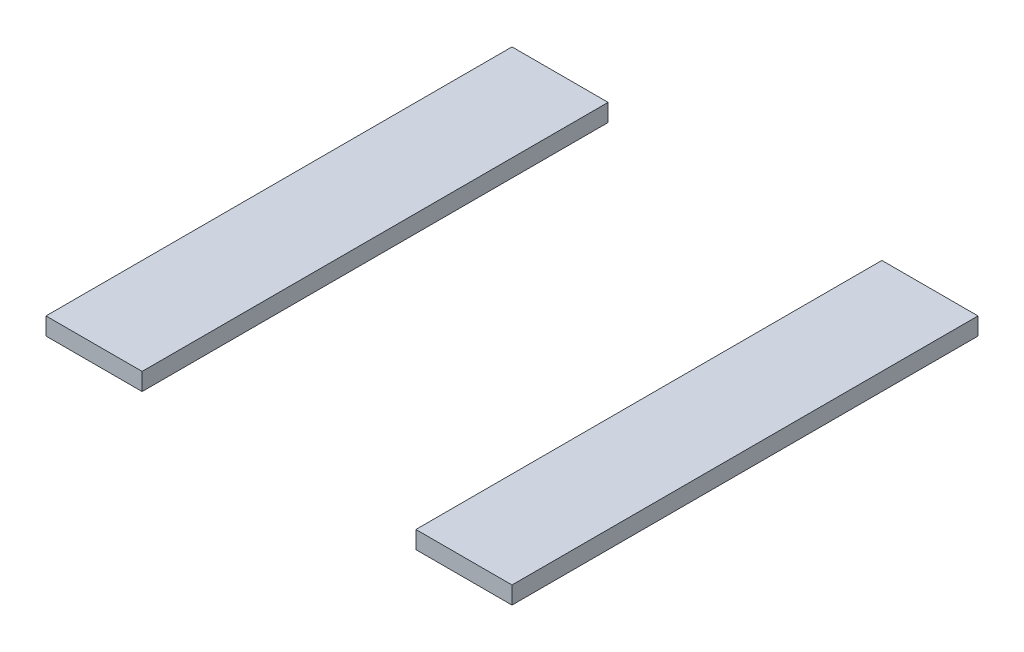
ISO-10303-21;
HEADER;
FILE_DESCRIPTION(('STEP AP214'),'2;1');
FILE_NAME('part.step','',(''),(''),'','','');
FILE_SCHEMA(('AUTOMOTIVE_DESIGN { 1 0 10303 214 1 1 1 1 }'));
ENDSEC;
DATA;
#1=APPLICATION_CONTEXT('core data for automotive mechanical design processes');
#2=APPLICATION_PROTOCOL_DEFINITION('international standard','automotive_design',2000,#1);
#3=PRODUCT_CONTEXT('',#1,'mechanical');
#4=PRODUCT('Part','Part','',(#3));
#5=PRODUCT_RELATED_PRODUCT_CATEGORY('part','',(#4));
#6=PRODUCT_DEFINITION_FORMATION('','',#4);
#7=PRODUCT_DEFINITION_CONTEXT('part definition',#1,'design');
#8=PRODUCT_DEFINITION('design','',#6,#7);
#9=PRODUCT_DEFINITION_SHAPE('','',#8);
#10=(LENGTH_UNIT() NAMED_UNIT(*) SI_UNIT(.MILLI.,.METRE.));
#11=(NAMED_UNIT(*) PLANE_ANGLE_UNIT() SI_UNIT($,.RADIAN.));
#12=(NAMED_UNIT(*) SI_UNIT($,.STERADIAN.) SOLID_ANGLE_UNIT());
#13=UNCERTAINTY_MEASURE_WITH_UNIT(LENGTH_MEASURE(1.E-05),#10,'distance_accuracy_value','');
#14=(GEOMETRIC_REPRESENTATION_CONTEXT(3) GLOBAL_UNCERTAINTY_ASSIGNED_CONTEXT((#13)) GLOBAL_UNIT_ASSIGNED_CONTEXT((#10,
#11,#12)) REPRESENTATION_CONTEXT('',''));
#15=CARTESIAN_POINT('',(0.,0.,0.));
#16=DIRECTION('',(0.,0.,1.));
#17=DIRECTION('',(1.,0.,0.));
#18=AXIS2_PLACEMENT_3D('',#15,#16,#17);
#19=CARTESIAN_POINT('',(16.5,3.,-80.));
#20=DIRECTION('',(0.,0.,1.));
#21=DIRECTION('',(1.,0.,0.));
#22=AXIS2_PLACEMENT_3D('',#19,#20,#21);
#23=PLANE('',#22);
#24=DIRECTION('',(-1.,0.,0.));
#25=VECTOR('',#24,1.);
#26=CARTESIAN_POINT('',(16.5,0.,-80.));
#27=LINE('',#26,#25);
#28=CARTESIAN_POINT('',(16.5,0.,-80.));
#29=VERTEX_POINT('',#28);
#30=CARTESIAN_POINT('',(0.,0.,-80.));
#31=VERTEX_POINT('',#30);
#32=EDGE_CURVE('E106',#29,#31,#27,.T.);
#33=ORIENTED_EDGE('',*,*,#32,.T.);
#34=DIRECTION('',(0.,-1.,0.));
#35=VECTOR('',#34,1.);
#36=CARTESIAN_POINT('',(0.,3.,-80.));
#37=LINE('',#36,#35);
#38=CARTESIAN_POINT('',(0.,3.,-80.));
#39=VERTEX_POINT('',#38);
#40=EDGE_CURVE('E12',#39,#31,#37,.T.);
#41=ORIENTED_EDGE('',*,*,#40,.F.);
#42=DIRECTION('',(-1.,0.,0.));
#43=VECTOR('',#42,1.);
#44=CARTESIAN_POINT('',(16.5,3.,-80.));
#45=LINE('',#44,#43);
#46=CARTESIAN_POINT('',(16.5,3.,-80.));
#47=VERTEX_POINT('',#46);
#48=EDGE_CURVE('E94',#47,#39,#45,.T.);
#49=ORIENTED_EDGE('',*,*,#48,.F.);
#50=DIRECTION('',(0.,-1.,0.));
#51=VECTOR('',#50,1.);
#52=CARTESIAN_POINT('',(16.5,3.,-80.));
#53=LINE('',#52,#51);
#54=EDGE_CURVE('E102',#47,#29,#53,.T.);
#55=ORIENTED_EDGE('',*,*,#54,.T.);
#56=EDGE_LOOP('',(#33,#41,#49,#55));
#57=FACE_BOUND('',#56,.T.);
#58=ADVANCED_FACE('F43',(#57),#23,.F.);
#59=CARTESIAN_POINT('',(0.,3.,0.));
#60=DIRECTION('',(1.,0.,0.));
#61=DIRECTION('',(0.,0.,-1.));
#62=AXIS2_PLACEMENT_3D('',#59,#60,#61);
#63=PLANE('',#62);
#64=DIRECTION('',(0.,0.,1.));
#65=VECTOR('',#64,1.);
#66=CARTESIAN_POINT('',(0.,0.,0.));
#67=LINE('',#66,#65);
#68=CARTESIAN_POINT('',(0.,0.,0.));
#69=VERTEX_POINT('',#68);
#70=EDGE_CURVE('E98',#31,#69,#67,.T.);
#71=ORIENTED_EDGE('',*,*,#70,.T.);
#72=DIRECTION('',(0.,-1.,0.));
#73=VECTOR('',#72,1.);
#74=CARTESIAN_POINT('',(0.,3.,0.));
#75=LINE('',#74,#73);
#76=CARTESIAN_POINT('',(0.,3.,0.));
#77=VERTEX_POINT('',#76);
#78=EDGE_CURVE('E51',#77,#69,#75,.T.);
#79=ORIENTED_EDGE('',*,*,#78,.F.);
#80=DIRECTION('',(0.,0.,1.));
#81=VECTOR('',#80,1.);
#82=CARTESIAN_POINT('',(0.,3.,0.));
#83=LINE('',#82,#81);
#84=EDGE_CURVE('E89',#39,#77,#83,.T.);
#85=ORIENTED_EDGE('',*,*,#84,.F.);
#86=ORIENTED_EDGE('',*,*,#40,.T.);
#87=EDGE_LOOP('',(#71,#79,#85,#86));
#88=FACE_BOUND('',#87,.T.);
#89=ADVANCED_FACE('F97',(#88),#63,.F.);
#90=CARTESIAN_POINT('',(16.5,3.,0.));
#91=DIRECTION('',(0.,0.,-1.));
#92=DIRECTION('',(-1.,0.,0.));
#93=AXIS2_PLACEMENT_3D('',#90,#91,#92);
#94=PLANE('',#93);
#95=DIRECTION('',(1.,0.,0.));
#96=VECTOR('',#95,1.);
#97=CARTESIAN_POINT('',(16.5,0.,0.));
#98=LINE('',#97,#96);
#99=CARTESIAN_POINT('',(16.5,0.,0.));
#100=VERTEX_POINT('',#99);
#101=EDGE_CURVE('E76',#69,#100,#98,.T.);
#102=ORIENTED_EDGE('',*,*,#101,.T.);
#103=DIRECTION('',(0.,-1.,0.));
#104=VECTOR('',#103,1.);
#105=CARTESIAN_POINT('',(16.5,3.,0.));
#106=LINE('',#105,#104);
#107=CARTESIAN_POINT('',(16.5,3.,0.));
#108=VERTEX_POINT('',#107);
#109=EDGE_CURVE('E99',#108,#100,#106,.T.);
#110=ORIENTED_EDGE('',*,*,#109,.F.);
#111=DIRECTION('',(1.,0.,0.));
#112=VECTOR('',#111,1.);
#113=CARTESIAN_POINT('',(16.5,3.,0.));
#114=LINE('',#113,#112);
#115=EDGE_CURVE('E92',#77,#108,#114,.T.);
#116=ORIENTED_EDGE('',*,*,#115,.F.);
#117=ORIENTED_EDGE('',*,*,#78,.T.);
#118=EDGE_LOOP('',(#102,#110,#116,#117));
#119=FACE_BOUND('',#118,.T.);
#120=ADVANCED_FACE('F100',(#119),#94,.F.);
#121=CARTESIAN_POINT('',(16.5,3.,0.));
#122=DIRECTION('',(-1.,0.,0.));
#123=DIRECTION('',(0.,0.,1.));
#124=AXIS2_PLACEMENT_3D('',#121,#122,#123);
#125=PLANE('',#124);
#126=DIRECTION('',(0.,0.,-1.));
#127=VECTOR('',#126,1.);
#128=CARTESIAN_POINT('',(16.5,0.,0.));
#129=LINE('',#128,#127);
#130=EDGE_CURVE('E82',#100,#29,#129,.T.);
#131=ORIENTED_EDGE('',*,*,#130,.T.);
#132=ORIENTED_EDGE('',*,*,#54,.F.);
#133=DIRECTION('',(0.,0.,-1.));
#134=VECTOR('',#133,1.);
#135=CARTESIAN_POINT('',(16.5,3.,0.));
#136=LINE('',#135,#134);
#137=EDGE_CURVE('E59',#108,#47,#136,.T.);
#138=ORIENTED_EDGE('',*,*,#137,.F.);
#139=ORIENTED_EDGE('',*,*,#109,.T.);
#140=EDGE_LOOP('',(#131,#132,#138,#139));
#141=FACE_BOUND('',#140,.T.);
#142=ADVANCED_FACE('F113',(#141),#125,.F.);
#143=CARTESIAN_POINT('',(0.,3.,0.));
#144=DIRECTION('',(0.,-1.,0.));
#145=DIRECTION('',(0.,0.,-1.));
#146=AXIS2_PLACEMENT_3D('',#143,#144,#145);
#147=PLANE('',#146);
#148=ORIENTED_EDGE('',*,*,#48,.T.);
#149=ORIENTED_EDGE('',*,*,#84,.T.);
#150=ORIENTED_EDGE('',*,*,#115,.T.);
#151=ORIENTED_EDGE('',*,*,#137,.T.);
#152=EDGE_LOOP('',(#148,#149,#150,#151));
#153=FACE_BOUND('',#152,.T.);
#154=ADVANCED_FACE('F90',(#153),#147,.F.);
#155=CARTESIAN_POINT('',(0.,0.,0.));
#156=DIRECTION('',(0.,-1.,0.));
#157=DIRECTION('',(0.,0.,-1.));
#158=AXIS2_PLACEMENT_3D('',#155,#156,#157);
#159=PLANE('',#158);
#160=ORIENTED_EDGE('',*,*,#32,.F.);
#161=ORIENTED_EDGE('',*,*,#130,.F.);
#162=ORIENTED_EDGE('',*,*,#101,.F.);
#163=ORIENTED_EDGE('',*,*,#70,.F.);
#164=EDGE_LOOP('',(#160,#161,#162,#163));
#165=FACE_BOUND('',#164,.T.);
#166=ADVANCED_FACE('F116',(#165),#159,.T.);
#167=CLOSED_SHELL('',(#58,#89,#120,#142,#154,#166));
#168=MANIFOLD_SOLID_BREP('B2',#167);
#169=CARTESIAN_POINT('',(80.,3.,-80.));
#170=DIRECTION('',(0.,0.,1.));
#171=DIRECTION('',(1.,0.,0.));
#172=AXIS2_PLACEMENT_3D('',#169,#170,#171);
#173=PLANE('',#172);
#174=DIRECTION('',(-1.,0.,0.));
#175=VECTOR('',#174,1.);
#176=CARTESIAN_POINT('',(80.,0.,-80.));
#177=LINE('',#176,#175);
#178=CARTESIAN_POINT('',(80.,0.,-80.));
#179=VERTEX_POINT('',#178);
#180=CARTESIAN_POINT('',(63.5,0.,-80.));
#181=VERTEX_POINT('',#180);
#182=EDGE_CURVE('E230',#179,#181,#177,.T.);
#183=ORIENTED_EDGE('',*,*,#182,.T.);
#184=DIRECTION('',(0.,-1.,0.));
#185=VECTOR('',#184,1.);
#186=CARTESIAN_POINT('',(63.5,3.,-80.));
#187=LINE('',#186,#185);
#188=CARTESIAN_POINT('',(63.5,3.,-80.));
#189=VERTEX_POINT('',#188);
#190=EDGE_CURVE('E41',#189,#181,#187,.T.);
#191=ORIENTED_EDGE('',*,*,#190,.F.);
#192=DIRECTION('',(-1.,0.,0.));
#193=VECTOR('',#192,1.);
#194=CARTESIAN_POINT('',(80.,3.,-80.));
#195=LINE('',#194,#193);
#196=CARTESIAN_POINT('',(80.,3.,-80.));
#197=VERTEX_POINT('',#196);
#198=EDGE_CURVE('E218',#197,#189,#195,.T.);
#199=ORIENTED_EDGE('',*,*,#198,.F.);
#200=DIRECTION('',(0.,-1.,0.));
#201=VECTOR('',#200,1.);
#202=CARTESIAN_POINT('',(80.,3.,-80.));
#203=LINE('',#202,#201);
#204=EDGE_CURVE('E226',#197,#179,#203,.T.);
#205=ORIENTED_EDGE('',*,*,#204,.T.);
#206=EDGE_LOOP('',(#183,#191,#199,#205));
#207=FACE_BOUND('',#206,.T.);
#208=ADVANCED_FACE('F167',(#207),#173,.F.);
#209=CARTESIAN_POINT('',(63.5,3.,-80.));
#210=DIRECTION('',(1.,0.,0.));
#211=DIRECTION('',(0.,0.,-1.));
#212=AXIS2_PLACEMENT_3D('',#209,#210,#211);
#213=PLANE('',#212);
#214=DIRECTION('',(0.,0.,1.));
#215=VECTOR('',#214,1.);
#216=CARTESIAN_POINT('',(63.5,0.,-80.));
#217=LINE('',#216,#215);
#218=CARTESIAN_POINT('',(63.5,0.,0.));
#219=VERTEX_POINT('',#218);
#220=EDGE_CURVE('E222',#181,#219,#217,.T.);
#221=ORIENTED_EDGE('',*,*,#220,.T.);
#222=DIRECTION('',(0.,-1.,0.));
#223=VECTOR('',#222,1.);
#224=CARTESIAN_POINT('',(63.5,3.,0.));
#225=LINE('',#224,#223);
#226=CARTESIAN_POINT('',(63.5,3.,0.));
#227=VERTEX_POINT('',#226);
#228=EDGE_CURVE('E175',#227,#219,#225,.T.);
#229=ORIENTED_EDGE('',*,*,#228,.F.);
#230=DIRECTION('',(0.,0.,1.));
#231=VECTOR('',#230,1.);
#232=CARTESIAN_POINT('',(63.5,3.,-80.));
#233=LINE('',#232,#231);
#234=EDGE_CURVE('E213',#189,#227,#233,.T.);
#235=ORIENTED_EDGE('',*,*,#234,.F.);
#236=ORIENTED_EDGE('',*,*,#190,.T.);
#237=EDGE_LOOP('',(#221,#229,#235,#236));
#238=FACE_BOUND('',#237,.T.);
#239=ADVANCED_FACE('F221',(#238),#213,.F.);
#240=CARTESIAN_POINT('',(63.5,3.,0.));
#241=DIRECTION('',(0.,0.,-1.));
#242=DIRECTION('',(-1.,0.,0.));
#243=AXIS2_PLACEMENT_3D('',#240,#241,#242);
#244=PLANE('',#243);
#245=DIRECTION('',(1.,0.,0.));
#246=VECTOR('',#245,1.);
#247=CARTESIAN_POINT('',(63.5,0.,0.));
#248=LINE('',#247,#246);
#249=CARTESIAN_POINT('',(80.,0.,0.));
#250=VERTEX_POINT('',#249);
#251=EDGE_CURVE('E200',#219,#250,#248,.T.);
#252=ORIENTED_EDGE('',*,*,#251,.T.);
#253=DIRECTION('',(0.,-1.,0.));
#254=VECTOR('',#253,1.);
#255=CARTESIAN_POINT('',(80.,3.,0.));
#256=LINE('',#255,#254);
#257=CARTESIAN_POINT('',(80.,3.,0.));
#258=VERTEX_POINT('',#257);
#259=EDGE_CURVE('E223',#258,#250,#256,.T.);
#260=ORIENTED_EDGE('',*,*,#259,.F.);
#261=DIRECTION('',(1.,0.,0.));
#262=VECTOR('',#261,1.);
#263=CARTESIAN_POINT('',(63.5,3.,0.));
#264=LINE('',#263,#262);
#265=EDGE_CURVE('E216',#227,#258,#264,.T.);
#266=ORIENTED_EDGE('',*,*,#265,.F.);
#267=ORIENTED_EDGE('',*,*,#228,.T.);
#268=EDGE_LOOP('',(#252,#260,#266,#267));
#269=FACE_BOUND('',#268,.T.);
#270=ADVANCED_FACE('F224',(#269),#244,.F.);
#271=CARTESIAN_POINT('',(80.,3.,0.));
#272=DIRECTION('',(-1.,0.,0.));
#273=DIRECTION('',(0.,0.,1.));
#274=AXIS2_PLACEMENT_3D('',#271,#272,#273);
#275=PLANE('',#274);
#276=DIRECTION('',(0.,0.,-1.));
#277=VECTOR('',#276,1.);
#278=CARTESIAN_POINT('',(80.,0.,0.));
#279=LINE('',#278,#277);
#280=EDGE_CURVE('E206',#250,#179,#279,.T.);
#281=ORIENTED_EDGE('',*,*,#280,.T.);
#282=ORIENTED_EDGE('',*,*,#204,.F.);
#283=DIRECTION('',(0.,0.,-1.));
#284=VECTOR('',#283,1.);
#285=CARTESIAN_POINT('',(80.,3.,0.));
#286=LINE('',#285,#284);
#287=EDGE_CURVE('E183',#258,#197,#286,.T.);
#288=ORIENTED_EDGE('',*,*,#287,.F.);
#289=ORIENTED_EDGE('',*,*,#259,.T.);
#290=EDGE_LOOP('',(#281,#282,#288,#289));
#291=FACE_BOUND('',#290,.T.);
#292=ADVANCED_FACE('F237',(#291),#275,.F.);
#293=CARTESIAN_POINT('',(0.,3.,0.));
#294=DIRECTION('',(0.,1.,0.));
#295=DIRECTION('',(0.,0.,1.));
#296=AXIS2_PLACEMENT_3D('',#293,#294,#295);
#297=PLANE('',#296);
#298=ORIENTED_EDGE('',*,*,#198,.T.);
#299=ORIENTED_EDGE('',*,*,#234,.T.);
#300=ORIENTED_EDGE('',*,*,#265,.T.);
#301=ORIENTED_EDGE('',*,*,#287,.T.);
#302=EDGE_LOOP('',(#298,#299,#300,#301));
#303=FACE_BOUND('',#302,.T.);
#304=ADVANCED_FACE('F214',(#303),#297,.T.);
#305=CARTESIAN_POINT('',(0.,0.,0.));
#306=DIRECTION('',(0.,1.,0.));
#307=DIRECTION('',(0.,0.,1.));
#308=AXIS2_PLACEMENT_3D('',#305,#306,#307);
#309=PLANE('',#308);
#310=ORIENTED_EDGE('',*,*,#182,.F.);
#311=ORIENTED_EDGE('',*,*,#280,.F.);
#312=ORIENTED_EDGE('',*,*,#251,.F.);
#313=ORIENTED_EDGE('',*,*,#220,.F.);
#314=EDGE_LOOP('',(#310,#311,#312,#313));
#315=FACE_BOUND('',#314,.T.);
#316=ADVANCED_FACE('F240',(#315),#309,.F.);
#317=CLOSED_SHELL('',(#208,#239,#270,#292,#304,#316));
#318=MANIFOLD_SOLID_BREP('B6',#317);
#319=ADVANCED_BREP_SHAPE_REPRESENTATION('',(#18,#168,#318),#14);
#320=SHAPE_DEFINITION_REPRESENTATION(#9,#319);
ENDSEC;
END-ISO-10303-21;
